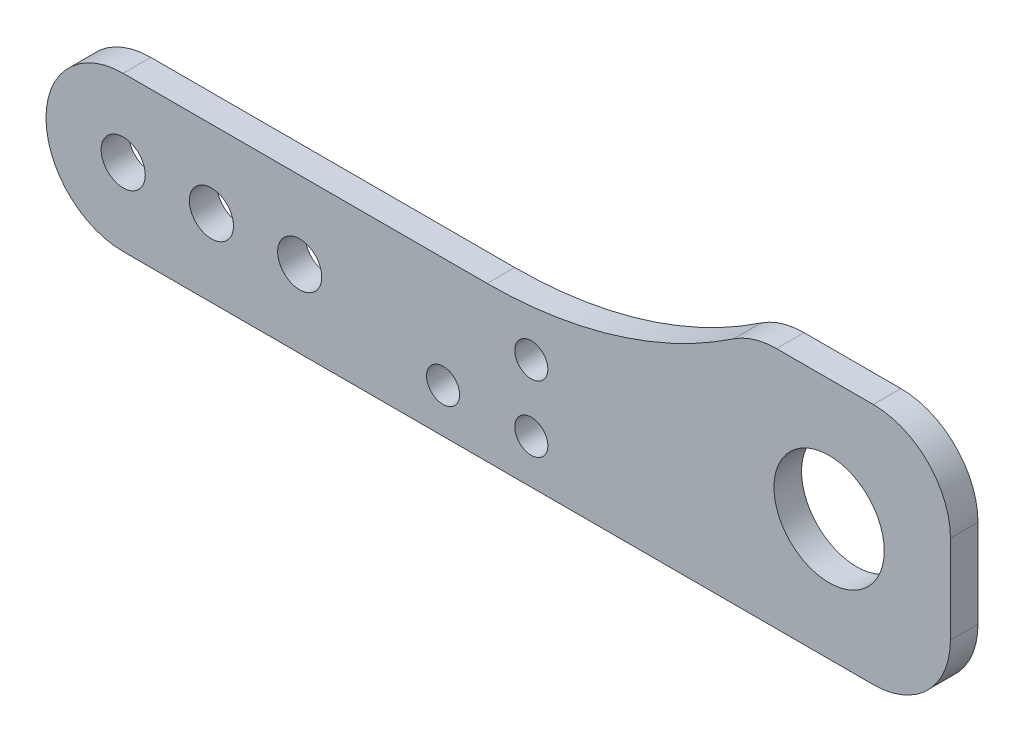
ISO-10303-21;
HEADER;
FILE_DESCRIPTION(('STEP AP214'),'2;1');
FILE_NAME('part.step','',(''),(''),'','','');
FILE_SCHEMA(('AUTOMOTIVE_DESIGN { 1 0 10303 214 1 1 1 1 }'));
ENDSEC;
DATA;
#1=APPLICATION_CONTEXT('core data for automotive mechanical design processes');
#2=APPLICATION_PROTOCOL_DEFINITION('international standard','automotive_design',2000,#1);
#3=PRODUCT_CONTEXT('',#1,'mechanical');
#4=PRODUCT('Part','Part','',(#3));
#5=PRODUCT_RELATED_PRODUCT_CATEGORY('part','',(#4));
#6=PRODUCT_DEFINITION_FORMATION('','',#4);
#7=PRODUCT_DEFINITION_CONTEXT('part definition',#1,'design');
#8=PRODUCT_DEFINITION('design','',#6,#7);
#9=PRODUCT_DEFINITION_SHAPE('','',#8);
#10=(LENGTH_UNIT() NAMED_UNIT(*) SI_UNIT(.MILLI.,.METRE.));
#11=(NAMED_UNIT(*) PLANE_ANGLE_UNIT() SI_UNIT($,.RADIAN.));
#12=(NAMED_UNIT(*) SI_UNIT($,.STERADIAN.) SOLID_ANGLE_UNIT());
#13=UNCERTAINTY_MEASURE_WITH_UNIT(LENGTH_MEASURE(1.E-05),#10,'distance_accuracy_value','');
#14=(GEOMETRIC_REPRESENTATION_CONTEXT(3) GLOBAL_UNCERTAINTY_ASSIGNED_CONTEXT((#13)) GLOBAL_UNIT_ASSIGNED_CONTEXT((#10,
#11,#12)) REPRESENTATION_CONTEXT('',''));
#15=CARTESIAN_POINT('',(0.,0.,0.));
#16=DIRECTION('',(0.,0.,1.));
#17=DIRECTION('',(1.,0.,0.));
#18=AXIS2_PLACEMENT_3D('',#15,#16,#17);
#19=CARTESIAN_POINT('',(68.,0.,2.5));
#20=DIRECTION('',(0.,0.,-1.));
#21=DIRECTION('',(-1.,0.,0.));
#22=AXIS2_PLACEMENT_3D('',#19,#20,#21);
#23=CYLINDRICAL_SURFACE('',#22,7.);
#24=CARTESIAN_POINT('',(68.,0.,0.));
#25=DIRECTION('',(0.,0.,1.));
#26=DIRECTION('',(1.,0.,0.));
#27=AXIS2_PLACEMENT_3D('',#24,#25,#26);
#28=CIRCLE('',#27,7.);
#29=CARTESIAN_POINT('',(68.,-6.99999999999999,0.));
#30=VERTEX_POINT('',#29);
#31=CARTESIAN_POINT('',(75.,0.,0.));
#32=VERTEX_POINT('',#31);
#33=EDGE_CURVE('E135',#30,#32,#28,.T.);
#34=ORIENTED_EDGE('',*,*,#33,.T.);
#35=DIRECTION('',(0.,0.,-1.));
#36=VECTOR('',#35,1.);
#37=CARTESIAN_POINT('',(75.,0.,2.5));
#38=LINE('',#37,#36);
#39=CARTESIAN_POINT('',(75.,0.,2.5));
#40=VERTEX_POINT('',#39);
#41=EDGE_CURVE('E11',#40,#32,#38,.T.);
#42=ORIENTED_EDGE('',*,*,#41,.F.);
#43=CARTESIAN_POINT('',(68.,0.,2.5));
#44=DIRECTION('',(0.,0.,1.));
#45=DIRECTION('',(1.,0.,0.));
#46=AXIS2_PLACEMENT_3D('',#43,#44,#45);
#47=CIRCLE('',#46,7.);
#48=CARTESIAN_POINT('',(68.,-6.99999999999999,2.5));
#49=VERTEX_POINT('',#48);
#50=EDGE_CURVE('E152',#49,#40,#47,.T.);
#51=ORIENTED_EDGE('',*,*,#50,.F.);
#52=DIRECTION('',(0.,0.,-1.));
#53=VECTOR('',#52,1.);
#54=CARTESIAN_POINT('',(68.,-6.99999999999999,2.5));
#55=LINE('',#54,#53);
#56=EDGE_CURVE('E131',#49,#30,#55,.T.);
#57=ORIENTED_EDGE('',*,*,#56,.T.);
#58=EDGE_LOOP('',(#34,#42,#51,#57));
#59=FACE_BOUND('',#58,.T.);
#60=ADVANCED_FACE('F33',(#59),#23,.T.);
#61=CARTESIAN_POINT('',(75.,0.,2.5));
#62=DIRECTION('',(-1.,0.,0.));
#63=DIRECTION('',(0.,-1.,0.));
#64=AXIS2_PLACEMENT_3D('',#61,#62,#63);
#65=PLANE('',#64);
#66=DIRECTION('',(0.,1.,0.));
#67=VECTOR('',#66,1.);
#68=CARTESIAN_POINT('',(75.,0.,0.));
#69=LINE('',#68,#67);
#70=CARTESIAN_POINT('',(75.,8.00000000000001,0.));
#71=VERTEX_POINT('',#70);
#72=EDGE_CURVE('E138',#32,#71,#69,.T.);
#73=ORIENTED_EDGE('',*,*,#72,.T.);
#74=DIRECTION('',(0.,0.,-1.));
#75=VECTOR('',#74,1.);
#76=CARTESIAN_POINT('',(75.,8.00000000000001,2.5));
#77=LINE('',#76,#75);
#78=CARTESIAN_POINT('',(75.,8.00000000000001,2.5));
#79=VERTEX_POINT('',#78);
#80=EDGE_CURVE('E41',#79,#71,#77,.T.);
#81=ORIENTED_EDGE('',*,*,#80,.F.);
#82=DIRECTION('',(0.,1.,0.));
#83=VECTOR('',#82,1.);
#84=CARTESIAN_POINT('',(75.,0.,2.5));
#85=LINE('',#84,#83);
#86=EDGE_CURVE('E95',#40,#79,#85,.T.);
#87=ORIENTED_EDGE('',*,*,#86,.F.);
#88=ORIENTED_EDGE('',*,*,#41,.T.);
#89=EDGE_LOOP('',(#73,#81,#87,#88));
#90=FACE_BOUND('',#89,.T.);
#91=ADVANCED_FACE('F268',(#90),#65,.F.);
#92=CARTESIAN_POINT('',(68.,8.00000000000001,2.5));
#93=DIRECTION('',(0.,0.,-1.));
#94=DIRECTION('',(-1.,0.,0.));
#95=AXIS2_PLACEMENT_3D('',#92,#93,#94);
#96=CYLINDRICAL_SURFACE('',#95,7.);
#97=CARTESIAN_POINT('',(68.,8.00000000000001,0.));
#98=DIRECTION('',(0.,0.,1.));
#99=DIRECTION('',(-1.,0.,0.));
#100=AXIS2_PLACEMENT_3D('',#97,#98,#99);
#101=CIRCLE('',#100,7.);
#102=CARTESIAN_POINT('',(68.,15.,0.));
#103=VERTEX_POINT('',#102);
#104=EDGE_CURVE('E141',#71,#103,#101,.T.);
#105=ORIENTED_EDGE('',*,*,#104,.T.);
#106=DIRECTION('',(0.,0.,-1.));
#107=VECTOR('',#106,1.);
#108=CARTESIAN_POINT('',(68.,15.,2.5));
#109=LINE('',#108,#107);
#110=CARTESIAN_POINT('',(68.,15.,2.5));
#111=VERTEX_POINT('',#110);
#112=EDGE_CURVE('E162',#111,#103,#109,.T.);
#113=ORIENTED_EDGE('',*,*,#112,.F.);
#114=CARTESIAN_POINT('',(68.,8.00000000000001,2.5));
#115=DIRECTION('',(0.,0.,1.));
#116=DIRECTION('',(-1.,0.,0.));
#117=AXIS2_PLACEMENT_3D('',#114,#115,#116);
#118=CIRCLE('',#117,7.);
#119=EDGE_CURVE('E170',#79,#111,#118,.T.);
#120=ORIENTED_EDGE('',*,*,#119,.F.);
#121=ORIENTED_EDGE('',*,*,#80,.T.);
#122=EDGE_LOOP('',(#105,#113,#120,#121));
#123=FACE_BOUND('',#122,.T.);
#124=ADVANCED_FACE('F168',(#123),#96,.T.);
#125=CARTESIAN_POINT('',(59.229754097208,15.,2.5));
#126=DIRECTION('',(0.,-1.,0.));
#127=DIRECTION('',(0.,0.,-1.));
#128=AXIS2_PLACEMENT_3D('',#125,#126,#127);
#129=PLANE('',#128);
#130=DIRECTION('',(-1.,0.,0.));
#131=VECTOR('',#130,1.);
#132=CARTESIAN_POINT('',(59.229754097208,15.,0.));
#133=LINE('',#132,#131);
#134=CARTESIAN_POINT('',(59.229754097208,15.,0.));
#135=VERTEX_POINT('',#134);
#136=EDGE_CURVE('E143',#103,#135,#133,.T.);
#137=ORIENTED_EDGE('',*,*,#136,.T.);
#138=DIRECTION('',(0.,0.,-1.));
#139=VECTOR('',#138,1.);
#140=CARTESIAN_POINT('',(59.229754097208,15.,2.5));
#141=LINE('',#140,#139);
#142=CARTESIAN_POINT('',(59.229754097208,15.,2.5));
#143=VERTEX_POINT('',#142);
#144=EDGE_CURVE('E159',#143,#135,#141,.T.);
#145=ORIENTED_EDGE('',*,*,#144,.F.);
#146=DIRECTION('',(-1.,0.,0.));
#147=VECTOR('',#146,1.);
#148=CARTESIAN_POINT('',(59.229754097208,15.,2.5));
#149=LINE('',#148,#147);
#150=EDGE_CURVE('E186',#111,#143,#149,.T.);
#151=ORIENTED_EDGE('',*,*,#150,.F.);
#152=ORIENTED_EDGE('',*,*,#112,.T.);
#153=EDGE_LOOP('',(#137,#145,#151,#152));
#154=FACE_BOUND('',#153,.T.);
#155=ADVANCED_FACE('F179',(#154),#129,.F.);
#156=CARTESIAN_POINT('',(59.229754097208,8.00000000000001,2.5));
#157=DIRECTION('',(0.,0.,-1.));
#158=DIRECTION('',(-1.,0.,0.));
#159=AXIS2_PLACEMENT_3D('',#156,#157,#158);
#160=CYLINDRICAL_SURFACE('',#159,7.);
#161=CARTESIAN_POINT('',(59.229754097208,8.00000000000001,0.));
#162=DIRECTION('',(0.,0.,1.));
#163=DIRECTION('',(1.,0.,0.));
#164=AXIS2_PLACEMENT_3D('',#161,#162,#163);
#165=CIRCLE('',#164,7.);
#166=CARTESIAN_POINT('',(55.3231949763472,13.8085106382979,0.));
#167=VERTEX_POINT('',#166);
#168=EDGE_CURVE('E145',#135,#167,#165,.T.);
#169=ORIENTED_EDGE('',*,*,#168,.T.);
#170=DIRECTION('',(0.,0.,-1.));
#171=VECTOR('',#170,1.);
#172=CARTESIAN_POINT('',(55.3231949763472,13.8085106382979,2.5));
#173=LINE('',#172,#171);
#174=CARTESIAN_POINT('',(55.3231949763472,13.8085106382979,2.5));
#175=VERTEX_POINT('',#174);
#176=EDGE_CURVE('E156',#175,#167,#173,.T.);
#177=ORIENTED_EDGE('',*,*,#176,.F.);
#178=CARTESIAN_POINT('',(59.229754097208,8.00000000000001,2.5));
#179=DIRECTION('',(0.,0.,1.));
#180=DIRECTION('',(1.,0.,0.));
#181=AXIS2_PLACEMENT_3D('',#178,#179,#180);
#182=CIRCLE('',#181,7.);
#183=EDGE_CURVE('E185',#143,#175,#182,.T.);
#184=ORIENTED_EDGE('',*,*,#183,.F.);
#185=ORIENTED_EDGE('',*,*,#144,.T.);
#186=EDGE_LOOP('',(#169,#177,#184,#185));
#187=FACE_BOUND('',#186,.T.);
#188=ADVANCED_FACE('F183',(#187),#160,.T.);
#189=CARTESIAN_POINT('',(33.,47.,2.5));
#190=DIRECTION('',(0.,0.,-1.));
#191=DIRECTION('',(-1.,0.,0.));
#192=AXIS2_PLACEMENT_3D('',#189,#190,#191);
#193=CYLINDRICAL_SURFACE('',#192,40.);
#194=CARTESIAN_POINT('',(33.,47.,0.));
#195=DIRECTION('',(0.,0.,-1.));
#196=DIRECTION('',(1.,0.,0.));
#197=AXIS2_PLACEMENT_3D('',#194,#195,#196);
#198=CIRCLE('',#197,40.);
#199=CARTESIAN_POINT('',(33.,7.,0.));
#200=VERTEX_POINT('',#199);
#201=EDGE_CURVE('E147',#167,#200,#198,.T.);
#202=ORIENTED_EDGE('',*,*,#201,.T.);
#203=DIRECTION('',(0.,0.,-1.));
#204=VECTOR('',#203,1.);
#205=CARTESIAN_POINT('',(33.,7.,2.5));
#206=LINE('',#205,#204);
#207=CARTESIAN_POINT('',(33.,7.,2.5));
#208=VERTEX_POINT('',#207);
#209=EDGE_CURVE('E126',#208,#200,#206,.T.);
#210=ORIENTED_EDGE('',*,*,#209,.F.);
#211=CARTESIAN_POINT('',(33.,47.,2.5));
#212=DIRECTION('',(0.,0.,-1.));
#213=DIRECTION('',(1.,0.,0.));
#214=AXIS2_PLACEMENT_3D('',#211,#212,#213);
#215=CIRCLE('',#214,40.);
#216=EDGE_CURVE('E117',#175,#208,#215,.T.);
#217=ORIENTED_EDGE('',*,*,#216,.F.);
#218=ORIENTED_EDGE('',*,*,#176,.T.);
#219=EDGE_LOOP('',(#202,#210,#217,#218));
#220=FACE_BOUND('',#219,.T.);
#221=ADVANCED_FACE('F276',(#220),#193,.F.);
#222=CARTESIAN_POINT('',(0.,7.,2.5));
#223=DIRECTION('',(0.,-1.,0.));
#224=DIRECTION('',(1.,0.,0.));
#225=AXIS2_PLACEMENT_3D('',#222,#223,#224);
#226=PLANE('',#225);
#227=DIRECTION('',(-1.,0.,0.));
#228=VECTOR('',#227,1.);
#229=CARTESIAN_POINT('',(0.,7.,0.));
#230=LINE('',#229,#228);
#231=CARTESIAN_POINT('',(0.,7.,0.));
#232=VERTEX_POINT('',#231);
#233=EDGE_CURVE('E125',#200,#232,#230,.T.);
#234=ORIENTED_EDGE('',*,*,#233,.T.);
#235=DIRECTION('',(0.,0.,-1.));
#236=VECTOR('',#235,1.);
#237=CARTESIAN_POINT('',(0.,7.,2.5));
#238=LINE('',#237,#236);
#239=CARTESIAN_POINT('',(0.,7.,2.5));
#240=VERTEX_POINT('',#239);
#241=EDGE_CURVE('E122',#240,#232,#238,.T.);
#242=ORIENTED_EDGE('',*,*,#241,.F.);
#243=DIRECTION('',(-1.,0.,0.));
#244=VECTOR('',#243,1.);
#245=CARTESIAN_POINT('',(0.,7.,2.5));
#246=LINE('',#245,#244);
#247=EDGE_CURVE('E111',#208,#240,#246,.T.);
#248=ORIENTED_EDGE('',*,*,#247,.F.);
#249=ORIENTED_EDGE('',*,*,#209,.T.);
#250=EDGE_LOOP('',(#234,#242,#248,#249));
#251=FACE_BOUND('',#250,.T.);
#252=ADVANCED_FACE('F123',(#251),#226,.F.);
#253=CARTESIAN_POINT('',(0.,0.,2.5));
#254=DIRECTION('',(0.,0.,-1.));
#255=DIRECTION('',(-1.,0.,0.));
#256=AXIS2_PLACEMENT_3D('',#253,#254,#255);
#257=CYLINDRICAL_SURFACE('',#256,7.);
#258=CARTESIAN_POINT('',(0.,0.,0.));
#259=DIRECTION('',(0.,0.,1.));
#260=DIRECTION('',(-1.,0.,0.));
#261=AXIS2_PLACEMENT_3D('',#258,#259,#260);
#262=CIRCLE('',#261,7.);
#263=CARTESIAN_POINT('',(0.,-7.,0.));
#264=VERTEX_POINT('',#263);
#265=EDGE_CURVE('E81',#232,#264,#262,.T.);
#266=ORIENTED_EDGE('',*,*,#265,.T.);
#267=DIRECTION('',(0.,0.,-1.));
#268=VECTOR('',#267,1.);
#269=CARTESIAN_POINT('',(0.,-7.,2.5));
#270=LINE('',#269,#268);
#271=CARTESIAN_POINT('',(0.,-7.,2.5));
#272=VERTEX_POINT('',#271);
#273=EDGE_CURVE('E127',#272,#264,#270,.T.);
#274=ORIENTED_EDGE('',*,*,#273,.F.);
#275=CARTESIAN_POINT('',(0.,0.,2.5));
#276=DIRECTION('',(0.,0.,1.));
#277=DIRECTION('',(-1.,0.,0.));
#278=AXIS2_PLACEMENT_3D('',#275,#276,#277);
#279=CIRCLE('',#278,7.);
#280=EDGE_CURVE('E115',#240,#272,#279,.T.);
#281=ORIENTED_EDGE('',*,*,#280,.F.);
#282=ORIENTED_EDGE('',*,*,#241,.T.);
#283=EDGE_LOOP('',(#266,#274,#281,#282));
#284=FACE_BOUND('',#283,.T.);
#285=ADVANCED_FACE('F129',(#284),#257,.T.);
#286=CARTESIAN_POINT('',(68.,-6.99999999999999,2.5));
#287=DIRECTION('',(0.,1.,0.));
#288=DIRECTION('',(-1.,0.,0.));
#289=AXIS2_PLACEMENT_3D('',#286,#287,#288);
#290=PLANE('',#289);
#291=DIRECTION('',(1.,0.,0.));
#292=VECTOR('',#291,1.);
#293=CARTESIAN_POINT('',(68.,-6.99999999999999,0.));
#294=LINE('',#293,#292);
#295=EDGE_CURVE('E87',#264,#30,#294,.T.);
#296=ORIENTED_EDGE('',*,*,#295,.T.);
#297=ORIENTED_EDGE('',*,*,#56,.F.);
#298=DIRECTION('',(1.,0.,0.));
#299=VECTOR('',#298,1.);
#300=CARTESIAN_POINT('',(68.,-6.99999999999999,2.5));
#301=LINE('',#300,#299);
#302=EDGE_CURVE('E49',#272,#49,#301,.T.);
#303=ORIENTED_EDGE('',*,*,#302,.F.);
#304=ORIENTED_EDGE('',*,*,#273,.T.);
#305=EDGE_LOOP('',(#296,#297,#303,#304));
#306=FACE_BOUND('',#305,.T.);
#307=ADVANCED_FACE('F239',(#306),#290,.F.);
#308=CARTESIAN_POINT('',(68.,0.,2.5));
#309=DIRECTION('',(0.,0.,1.));
#310=DIRECTION('',(1.,0.,0.));
#311=AXIS2_PLACEMENT_3D('',#308,#309,#310);
#312=PLANE('',#311);
#313=CARTESIAN_POINT('',(29.,-3.00000000000019,2.5));
#314=DIRECTION('',(0.,0.,1.));
#315=DIRECTION('',(1.,0.,0.));
#316=AXIS2_PLACEMENT_3D('',#313,#314,#315);
#317=CIRCLE('',#316,1.5);
#318=CARTESIAN_POINT('',(30.5,-3.00000000000019,2.5));
#319=VERTEX_POINT('',#318);
#320=EDGE_CURVE('E231',#319,#319,#317,.T.);
#321=ORIENTED_EDGE('',*,*,#320,.F.);
#322=EDGE_LOOP('',(#321));
#323=FACE_BOUND('',#322,.T.);
#324=CARTESIAN_POINT('',(37.,-3.00000000000019,2.5));
#325=DIRECTION('',(0.,0.,1.));
#326=DIRECTION('',(1.,0.,0.));
#327=AXIS2_PLACEMENT_3D('',#324,#325,#326);
#328=CIRCLE('',#327,1.5);
#329=CARTESIAN_POINT('',(38.5,-3.00000000000019,2.5));
#330=VERTEX_POINT('',#329);
#331=EDGE_CURVE('E225',#330,#330,#328,.T.);
#332=ORIENTED_EDGE('',*,*,#331,.F.);
#333=EDGE_LOOP('',(#332));
#334=FACE_BOUND('',#333,.T.);
#335=CARTESIAN_POINT('',(37.,2.99999999999981,2.5));
#336=DIRECTION('',(0.,0.,1.));
#337=DIRECTION('',(1.,0.,0.));
#338=AXIS2_PLACEMENT_3D('',#335,#336,#337);
#339=CIRCLE('',#338,1.5);
#340=CARTESIAN_POINT('',(38.5,2.99999999999981,2.5));
#341=VERTEX_POINT('',#340);
#342=EDGE_CURVE('E219',#341,#341,#339,.T.);
#343=ORIENTED_EDGE('',*,*,#342,.F.);
#344=EDGE_LOOP('',(#343));
#345=FACE_BOUND('',#344,.T.);
#346=CARTESIAN_POINT('',(64.,4.00000000000001,2.5));
#347=DIRECTION('',(0.,0.,1.));
#348=DIRECTION('',(1.,0.,0.));
#349=AXIS2_PLACEMENT_3D('',#346,#347,#348);
#350=CIRCLE('',#349,5.);
#351=CARTESIAN_POINT('',(69.,4.00000000000001,2.5));
#352=VERTEX_POINT('',#351);
#353=EDGE_CURVE('E213',#352,#352,#350,.T.);
#354=ORIENTED_EDGE('',*,*,#353,.F.);
#355=EDGE_LOOP('',(#354));
#356=FACE_BOUND('',#355,.T.);
#357=CARTESIAN_POINT('',(0.,0.,2.5));
#358=DIRECTION('',(0.,0.,1.));
#359=DIRECTION('',(1.,0.,0.));
#360=AXIS2_PLACEMENT_3D('',#357,#358,#359);
#361=CIRCLE('',#360,2.);
#362=CARTESIAN_POINT('',(2.,0.,2.5));
#363=VERTEX_POINT('',#362);
#364=EDGE_CURVE('E204',#363,#363,#361,.T.);
#365=ORIENTED_EDGE('',*,*,#364,.F.);
#366=EDGE_LOOP('',(#365));
#367=FACE_BOUND('',#366,.T.);
#368=CARTESIAN_POINT('',(8.,0.,2.5));
#369=DIRECTION('',(0.,0.,1.));
#370=DIRECTION('',(1.,0.,0.));
#371=AXIS2_PLACEMENT_3D('',#368,#369,#370);
#372=CIRCLE('',#371,2.);
#373=CARTESIAN_POINT('',(10.,0.,2.5));
#374=VERTEX_POINT('',#373);
#375=EDGE_CURVE('E196',#374,#374,#372,.T.);
#376=ORIENTED_EDGE('',*,*,#375,.F.);
#377=EDGE_LOOP('',(#376));
#378=FACE_BOUND('',#377,.T.);
#379=CARTESIAN_POINT('',(16.,0.,2.5));
#380=DIRECTION('',(0.,0.,1.));
#381=DIRECTION('',(1.,0.,0.));
#382=AXIS2_PLACEMENT_3D('',#379,#380,#381);
#383=CIRCLE('',#382,2.);
#384=CARTESIAN_POINT('',(18.,0.,2.5));
#385=VERTEX_POINT('',#384);
#386=EDGE_CURVE('E197',#385,#385,#383,.T.);
#387=ORIENTED_EDGE('',*,*,#386,.F.);
#388=EDGE_LOOP('',(#387));
#389=FACE_BOUND('',#388,.T.);
#390=ORIENTED_EDGE('',*,*,#50,.T.);
#391=ORIENTED_EDGE('',*,*,#86,.T.);
#392=ORIENTED_EDGE('',*,*,#119,.T.);
#393=ORIENTED_EDGE('',*,*,#150,.T.);
#394=ORIENTED_EDGE('',*,*,#183,.T.);
#395=ORIENTED_EDGE('',*,*,#216,.T.);
#396=ORIENTED_EDGE('',*,*,#247,.T.);
#397=ORIENTED_EDGE('',*,*,#280,.T.);
#398=ORIENTED_EDGE('',*,*,#302,.T.);
#399=EDGE_LOOP('',(#390,#391,#392,#393,#394,#395,#396,#397,#398));
#400=FACE_BOUND('',#399,.T.);
#401=ADVANCED_FACE('F113',(#323,#334,#345,#356,#367,#378,#389,#400),#312,.T.);
#402=CARTESIAN_POINT('',(68.,0.,0.));
#403=DIRECTION('',(0.,0.,1.));
#404=DIRECTION('',(1.,0.,0.));
#405=AXIS2_PLACEMENT_3D('',#402,#403,#404);
#406=PLANE('',#405);
#407=CARTESIAN_POINT('',(29.,-3.00000000000019,0.));
#408=DIRECTION('',(0.,0.,1.));
#409=DIRECTION('',(1.,0.,0.));
#410=AXIS2_PLACEMENT_3D('',#407,#408,#409);
#411=CIRCLE('',#410,1.5);
#412=CARTESIAN_POINT('',(30.5,-3.00000000000019,0.));
#413=VERTEX_POINT('',#412);
#414=EDGE_CURVE('E228',#413,#413,#411,.T.);
#415=ORIENTED_EDGE('',*,*,#414,.T.);
#416=EDGE_LOOP('',(#415));
#417=FACE_BOUND('',#416,.T.);
#418=CARTESIAN_POINT('',(37.,-3.00000000000019,0.));
#419=DIRECTION('',(0.,0.,1.));
#420=DIRECTION('',(1.,0.,0.));
#421=AXIS2_PLACEMENT_3D('',#418,#419,#420);
#422=CIRCLE('',#421,1.5);
#423=CARTESIAN_POINT('',(38.5,-3.00000000000019,0.));
#424=VERTEX_POINT('',#423);
#425=EDGE_CURVE('E222',#424,#424,#422,.T.);
#426=ORIENTED_EDGE('',*,*,#425,.T.);
#427=EDGE_LOOP('',(#426));
#428=FACE_BOUND('',#427,.T.);
#429=CARTESIAN_POINT('',(37.,2.99999999999981,0.));
#430=DIRECTION('',(0.,0.,1.));
#431=DIRECTION('',(1.,0.,0.));
#432=AXIS2_PLACEMENT_3D('',#429,#430,#431);
#433=CIRCLE('',#432,1.5);
#434=CARTESIAN_POINT('',(38.5,2.99999999999981,0.));
#435=VERTEX_POINT('',#434);
#436=EDGE_CURVE('E216',#435,#435,#433,.T.);
#437=ORIENTED_EDGE('',*,*,#436,.T.);
#438=EDGE_LOOP('',(#437));
#439=FACE_BOUND('',#438,.T.);
#440=CARTESIAN_POINT('',(64.,4.00000000000001,0.));
#441=DIRECTION('',(0.,0.,1.));
#442=DIRECTION('',(1.,0.,0.));
#443=AXIS2_PLACEMENT_3D('',#440,#441,#442);
#444=CIRCLE('',#443,5.);
#445=CARTESIAN_POINT('',(69.,4.00000000000001,0.));
#446=VERTEX_POINT('',#445);
#447=EDGE_CURVE('E200',#446,#446,#444,.F.);
#448=ORIENTED_EDGE('',*,*,#447,.F.);
#449=EDGE_LOOP('',(#448));
#450=FACE_BOUND('',#449,.T.);
#451=CARTESIAN_POINT('',(0.,0.,0.));
#452=DIRECTION('',(0.,0.,1.));
#453=DIRECTION('',(1.,0.,0.));
#454=AXIS2_PLACEMENT_3D('',#451,#452,#453);
#455=CIRCLE('',#454,2.);
#456=CARTESIAN_POINT('',(2.,0.,0.));
#457=VERTEX_POINT('',#456);
#458=EDGE_CURVE('E139',#457,#457,#455,.F.);
#459=ORIENTED_EDGE('',*,*,#458,.F.);
#460=EDGE_LOOP('',(#459));
#461=FACE_BOUND('',#460,.T.);
#462=CARTESIAN_POINT('',(8.,0.,0.));
#463=DIRECTION('',(0.,0.,1.));
#464=DIRECTION('',(1.,0.,0.));
#465=AXIS2_PLACEMENT_3D('',#462,#463,#464);
#466=CIRCLE('',#465,2.);
#467=CARTESIAN_POINT('',(10.,0.,0.));
#468=VERTEX_POINT('',#467);
#469=EDGE_CURVE('E201',#468,#468,#466,.F.);
#470=ORIENTED_EDGE('',*,*,#469,.F.);
#471=EDGE_LOOP('',(#470));
#472=FACE_BOUND('',#471,.T.);
#473=CARTESIAN_POINT('',(16.,0.,0.));
#474=DIRECTION('',(0.,0.,1.));
#475=DIRECTION('',(1.,0.,0.));
#476=AXIS2_PLACEMENT_3D('',#473,#474,#475);
#477=CIRCLE('',#476,2.);
#478=CARTESIAN_POINT('',(18.,0.,0.));
#479=VERTEX_POINT('',#478);
#480=EDGE_CURVE('E193',#479,#479,#477,.F.);
#481=ORIENTED_EDGE('',*,*,#480,.F.);
#482=EDGE_LOOP('',(#481));
#483=FACE_BOUND('',#482,.T.);
#484=ORIENTED_EDGE('',*,*,#33,.F.);
#485=ORIENTED_EDGE('',*,*,#295,.F.);
#486=ORIENTED_EDGE('',*,*,#265,.F.);
#487=ORIENTED_EDGE('',*,*,#233,.F.);
#488=ORIENTED_EDGE('',*,*,#201,.F.);
#489=ORIENTED_EDGE('',*,*,#168,.F.);
#490=ORIENTED_EDGE('',*,*,#136,.F.);
#491=ORIENTED_EDGE('',*,*,#104,.F.);
#492=ORIENTED_EDGE('',*,*,#72,.F.);
#493=EDGE_LOOP('',(#484,#485,#486,#487,#488,#489,#490,#491,#492));
#494=FACE_BOUND('',#493,.T.);
#495=ADVANCED_FACE('F174',(#417,#428,#439,#450,#461,#472,#483,#494),#406,.F.);
#496=CARTESIAN_POINT('',(16.,0.,-5.65685424949239));
#497=DIRECTION('',(0.,0.,1.));
#498=DIRECTION('',(1.,0.,0.));
#499=AXIS2_PLACEMENT_3D('',#496,#497,#498);
#500=CYLINDRICAL_SURFACE('',#499,2.);
#501=ORIENTED_EDGE('',*,*,#480,.T.);
#502=EDGE_LOOP('',(#501));
#503=FACE_BOUND('',#502,.T.);
#504=ORIENTED_EDGE('',*,*,#386,.T.);
#505=EDGE_LOOP('',(#504));
#506=FACE_BOUND('',#505,.T.);
#507=ADVANCED_FACE('F253',(#503,#506),#500,.F.);
#508=CARTESIAN_POINT('',(8.,0.,-5.65685424949239));
#509=DIRECTION('',(0.,0.,1.));
#510=DIRECTION('',(1.,0.,0.));
#511=AXIS2_PLACEMENT_3D('',#508,#509,#510);
#512=CYLINDRICAL_SURFACE('',#511,2.);
#513=ORIENTED_EDGE('',*,*,#469,.T.);
#514=EDGE_LOOP('',(#513));
#515=FACE_BOUND('',#514,.T.);
#516=ORIENTED_EDGE('',*,*,#375,.T.);
#517=EDGE_LOOP('',(#516));
#518=FACE_BOUND('',#517,.T.);
#519=ADVANCED_FACE('F255',(#515,#518),#512,.F.);
#520=CARTESIAN_POINT('',(0.,0.,-5.65685424949239));
#521=DIRECTION('',(0.,0.,1.));
#522=DIRECTION('',(1.,0.,0.));
#523=AXIS2_PLACEMENT_3D('',#520,#521,#522);
#524=CYLINDRICAL_SURFACE('',#523,2.);
#525=ORIENTED_EDGE('',*,*,#458,.T.);
#526=EDGE_LOOP('',(#525));
#527=FACE_BOUND('',#526,.T.);
#528=ORIENTED_EDGE('',*,*,#364,.T.);
#529=EDGE_LOOP('',(#528));
#530=FACE_BOUND('',#529,.T.);
#531=ADVANCED_FACE('F262',(#527,#530),#524,.F.);
#532=CARTESIAN_POINT('',(64.,4.00000000000001,-14.142135623731));
#533=DIRECTION('',(0.,0.,1.));
#534=DIRECTION('',(1.,0.,0.));
#535=AXIS2_PLACEMENT_3D('',#532,#533,#534);
#536=CYLINDRICAL_SURFACE('',#535,5.);
#537=ORIENTED_EDGE('',*,*,#447,.T.);
#538=EDGE_LOOP('',(#537));
#539=FACE_BOUND('',#538,.T.);
#540=ORIENTED_EDGE('',*,*,#353,.T.);
#541=EDGE_LOOP('',(#540));
#542=FACE_BOUND('',#541,.T.);
#543=ADVANCED_FACE('F348',(#539,#542),#536,.F.);
#544=CARTESIAN_POINT('',(37.,2.99999999999981,2.5));
#545=DIRECTION('',(0.,0.,1.));
#546=DIRECTION('',(1.,0.,0.));
#547=AXIS2_PLACEMENT_3D('',#544,#545,#546);
#548=CYLINDRICAL_SURFACE('',#547,1.5);
#549=ORIENTED_EDGE('',*,*,#436,.F.);
#550=EDGE_LOOP('',(#549));
#551=FACE_BOUND('',#550,.T.);
#552=ORIENTED_EDGE('',*,*,#342,.T.);
#553=EDGE_LOOP('',(#552));
#554=FACE_BOUND('',#553,.T.);
#555=ADVANCED_FACE('F358',(#551,#554),#548,.F.);
#556=CARTESIAN_POINT('',(37.,-3.00000000000019,2.5));
#557=DIRECTION('',(0.,0.,1.));
#558=DIRECTION('',(1.,0.,0.));
#559=AXIS2_PLACEMENT_3D('',#556,#557,#558);
#560=CYLINDRICAL_SURFACE('',#559,1.5);
#561=ORIENTED_EDGE('',*,*,#425,.F.);
#562=EDGE_LOOP('',(#561));
#563=FACE_BOUND('',#562,.T.);
#564=ORIENTED_EDGE('',*,*,#331,.T.);
#565=EDGE_LOOP('',(#564));
#566=FACE_BOUND('',#565,.T.);
#567=ADVANCED_FACE('F378',(#563,#566),#560,.F.);
#568=CARTESIAN_POINT('',(29.,-3.00000000000019,2.5));
#569=DIRECTION('',(0.,0.,1.));
#570=DIRECTION('',(1.,0.,0.));
#571=AXIS2_PLACEMENT_3D('',#568,#569,#570);
#572=CYLINDRICAL_SURFACE('',#571,1.5);
#573=ORIENTED_EDGE('',*,*,#414,.F.);
#574=EDGE_LOOP('',(#573));
#575=FACE_BOUND('',#574,.T.);
#576=ORIENTED_EDGE('',*,*,#320,.T.);
#577=EDGE_LOOP('',(#576));
#578=FACE_BOUND('',#577,.T.);
#579=ADVANCED_FACE('F235',(#575,#578),#572,.F.);
#580=CLOSED_SHELL('',(#60,#91,#124,#155,#188,#221,#252,#285,#307,#401,#495,#507,#519,#531,#543,
#555,#567,#579));
#581=MANIFOLD_SOLID_BREP('B2',#580);
#582=ADVANCED_BREP_SHAPE_REPRESENTATION('',(#18,#581),#14);
#583=SHAPE_DEFINITION_REPRESENTATION(#9,#582);
ENDSEC;
END-ISO-10303-21;
